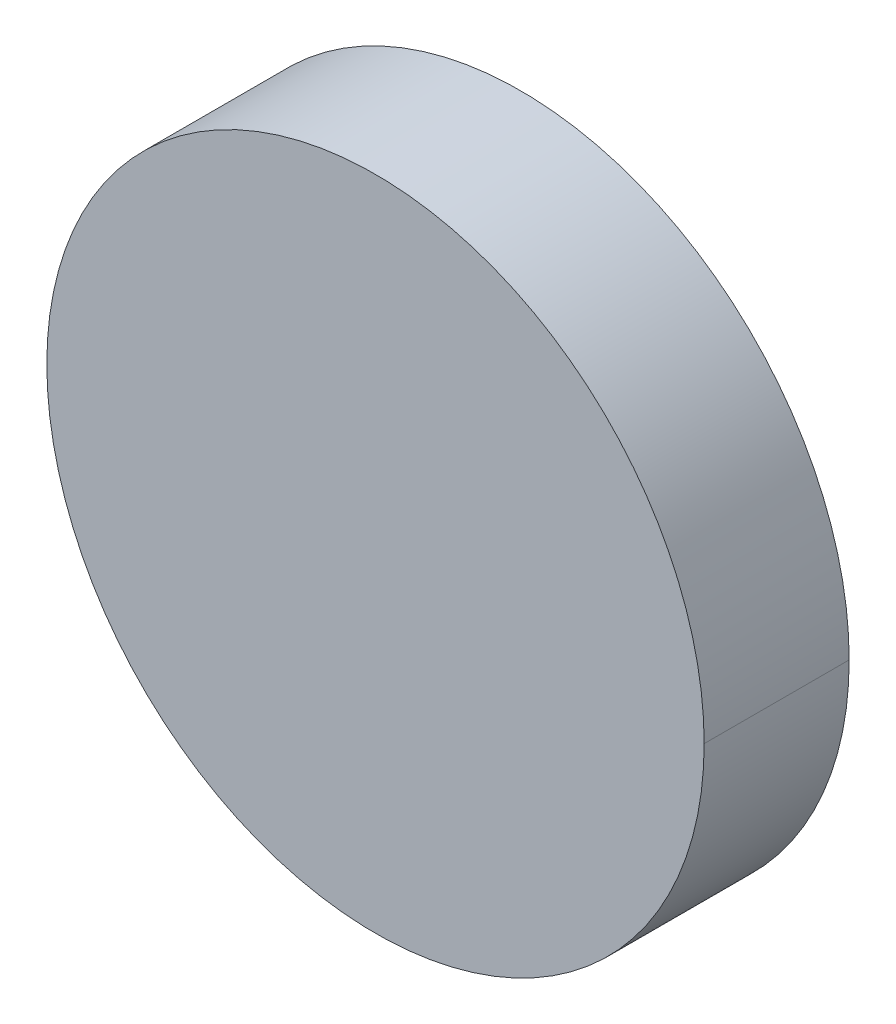
ISO-10303-21;
HEADER;
FILE_DESCRIPTION(('STEP AP214'),'2;1');
FILE_NAME('part.step','',(''),(''),'','','');
FILE_SCHEMA(('AUTOMOTIVE_DESIGN { 1 0 10303 214 1 1 1 1 }'));
ENDSEC;
DATA;
#1=APPLICATION_CONTEXT('core data for automotive mechanical design processes');
#2=APPLICATION_PROTOCOL_DEFINITION('international standard','automotive_design',2000,#1);
#3=PRODUCT_CONTEXT('',#1,'mechanical');
#4=PRODUCT('Part','Part','',(#3));
#5=PRODUCT_RELATED_PRODUCT_CATEGORY('part','',(#4));
#6=PRODUCT_DEFINITION_FORMATION('','',#4);
#7=PRODUCT_DEFINITION_CONTEXT('part definition',#1,'design');
#8=PRODUCT_DEFINITION('design','',#6,#7);
#9=PRODUCT_DEFINITION_SHAPE('','',#8);
#10=(LENGTH_UNIT() NAMED_UNIT(*) SI_UNIT(.MILLI.,.METRE.));
#11=(NAMED_UNIT(*) PLANE_ANGLE_UNIT() SI_UNIT($,.RADIAN.));
#12=(NAMED_UNIT(*) SI_UNIT($,.STERADIAN.) SOLID_ANGLE_UNIT());
#13=UNCERTAINTY_MEASURE_WITH_UNIT(LENGTH_MEASURE(1.E-05),#10,'distance_accuracy_value','');
#14=(GEOMETRIC_REPRESENTATION_CONTEXT(3) GLOBAL_UNCERTAINTY_ASSIGNED_CONTEXT((#13)) GLOBAL_UNIT_ASSIGNED_CONTEXT((#10,
#11,#12)) REPRESENTATION_CONTEXT('',''));
#15=CARTESIAN_POINT('',(0.,0.,0.));
#16=DIRECTION('',(0.,0.,1.));
#17=DIRECTION('',(1.,0.,0.));
#18=AXIS2_PLACEMENT_3D('',#15,#16,#17);
#19=CARTESIAN_POINT('',(0.,0.,0.));
#20=DIRECTION('',(0.,0.,1.));
#21=DIRECTION('',(1.,0.,0.));
#22=AXIS2_PLACEMENT_3D('',#19,#20,#21);
#23=PLANE('',#22);
#24=CARTESIAN_POINT('',(0.,0.,-3.72529047540371E-10));
#25=DIRECTION('',(0.,0.,1.));
#26=DIRECTION('',(-1.,0.,0.));
#27=AXIS2_PLACEMENT_3D('',#24,#25,#26);
#28=CIRCLE('',#27,2.04);
#29=CARTESIAN_POINT('',(-2.04,0.,-3.72529007642E-10));
#30=VERTEX_POINT('',#29);
#31=CARTESIAN_POINT('',(2.04,0.,-3.72529007642E-10));
#32=VERTEX_POINT('',#31);
#33=EDGE_CURVE('E11',#30,#32,#28,.T.);
#34=ORIENTED_EDGE('',*,*,#33,.F.);
#35=CARTESIAN_POINT('',(0.,0.,-3.72529007642E-10));
#36=DIRECTION('',(0.,0.,1.));
#37=DIRECTION('',(1.,0.,0.));
#38=AXIS2_PLACEMENT_3D('',#35,#36,#37);
#39=CIRCLE('',#38,2.04);
#40=EDGE_CURVE('E64',#32,#30,#39,.T.);
#41=ORIENTED_EDGE('',*,*,#40,.F.);
#42=EDGE_LOOP('',(#34,#41));
#43=FACE_BOUND('',#42,.T.);
#44=ADVANCED_FACE('F17',(#43),#23,.F.);
#45=CARTESIAN_POINT('',(0.,0.,0.9));
#46=DIRECTION('',(0.,0.,-1.));
#47=DIRECTION('',(-1.,0.,0.));
#48=AXIS2_PLACEMENT_3D('',#45,#46,#47);
#49=CYLINDRICAL_SURFACE('',#48,2.04);
#50=DIRECTION('',(0.,0.,-1.));
#51=VECTOR('',#50,1.);
#52=CARTESIAN_POINT('',(2.04,0.,0.900000000373));
#53=LINE('',#52,#51);
#54=CARTESIAN_POINT('',(2.04,0.,0.9));
#55=VERTEX_POINT('',#54);
#56=EDGE_CURVE('E55',#55,#32,#53,.T.);
#57=ORIENTED_EDGE('',*,*,#56,.F.);
#58=CARTESIAN_POINT('',(0.,0.,0.9));
#59=DIRECTION('',(0.,0.,1.));
#60=DIRECTION('',(1.,0.,0.));
#61=AXIS2_PLACEMENT_3D('',#58,#59,#60);
#62=CIRCLE('',#61,2.03999999911);
#63=CARTESIAN_POINT('',(-2.04,0.,0.9));
#64=VERTEX_POINT('',#63);
#65=EDGE_CURVE('E28',#64,#55,#62,.T.);
#66=ORIENTED_EDGE('',*,*,#65,.F.);
#67=DIRECTION('',(0.,0.,-1.));
#68=VECTOR('',#67,1.);
#69=CARTESIAN_POINT('',(-2.04,0.,0.900000000373));
#70=LINE('',#69,#68);
#71=EDGE_CURVE('E52',#64,#30,#70,.T.);
#72=ORIENTED_EDGE('',*,*,#71,.T.);
#73=ORIENTED_EDGE('',*,*,#33,.T.);
#74=EDGE_LOOP('',(#57,#66,#72,#73));
#75=FACE_BOUND('',#74,.T.);
#76=ADVANCED_FACE('F51',(#75),#49,.T.);
#77=CARTESIAN_POINT('',(0.,0.,0.9));
#78=DIRECTION('',(0.,0.,1.));
#79=DIRECTION('',(1.,0.,0.));
#80=AXIS2_PLACEMENT_3D('',#77,#78,#79);
#81=PLANE('',#80);
#82=ORIENTED_EDGE('',*,*,#65,.T.);
#83=CARTESIAN_POINT('',(0.,0.,0.9));
#84=DIRECTION('',(0.,0.,1.));
#85=DIRECTION('',(1.,0.,0.));
#86=AXIS2_PLACEMENT_3D('',#83,#84,#85);
#87=CIRCLE('',#86,2.04);
#88=EDGE_CURVE('E63',#55,#64,#87,.T.);
#89=ORIENTED_EDGE('',*,*,#88,.T.);
#90=EDGE_LOOP('',(#82,#89));
#91=FACE_BOUND('',#90,.T.);
#92=ADVANCED_FACE('F19',(#91),#81,.T.);
#93=CARTESIAN_POINT('',(0.,0.,0.9));
#94=DIRECTION('',(0.,0.,-1.));
#95=DIRECTION('',(-1.,0.,0.));
#96=AXIS2_PLACEMENT_3D('',#93,#94,#95);
#97=CYLINDRICAL_SURFACE('',#96,2.04);
#98=ORIENTED_EDGE('',*,*,#88,.F.);
#99=ORIENTED_EDGE('',*,*,#56,.T.);
#100=ORIENTED_EDGE('',*,*,#40,.T.);
#101=ORIENTED_EDGE('',*,*,#71,.F.);
#102=EDGE_LOOP('',(#98,#99,#100,#101));
#103=FACE_BOUND('',#102,.T.);
#104=ADVANCED_FACE('F62',(#103),#97,.T.);
#105=CLOSED_SHELL('',(#44,#76,#92,#104));
#106=MANIFOLD_SOLID_BREP('B1',#105);
#107=ADVANCED_BREP_SHAPE_REPRESENTATION('',(#18,#106),#14);
#108=SHAPE_DEFINITION_REPRESENTATION(#9,#107);
ENDSEC;
END-ISO-10303-21;
